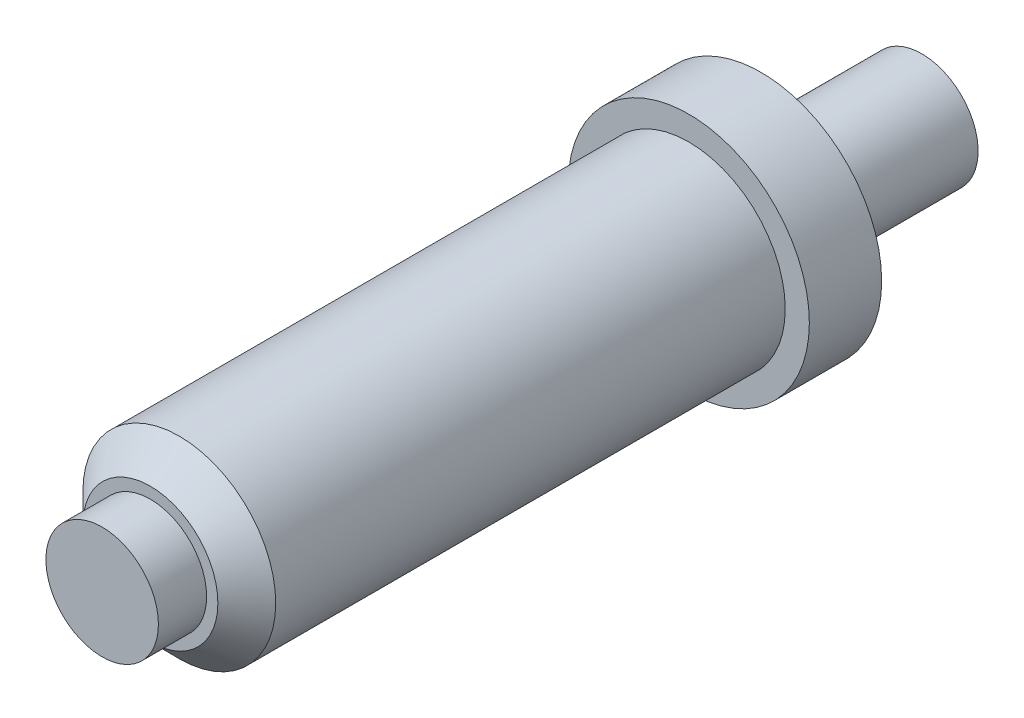
ISO-10303-21;
HEADER;
FILE_DESCRIPTION(('STEP AP214'),'2;1');
FILE_NAME('part.step','',(''),(''),'','','');
FILE_SCHEMA(('AUTOMOTIVE_DESIGN { 1 0 10303 214 1 1 1 1 }'));
ENDSEC;
DATA;
#1=APPLICATION_CONTEXT('core data for automotive mechanical design processes');
#2=APPLICATION_PROTOCOL_DEFINITION('international standard','automotive_design',2000,#1);
#3=PRODUCT_CONTEXT('',#1,'mechanical');
#4=PRODUCT('Part','Part','',(#3));
#5=PRODUCT_RELATED_PRODUCT_CATEGORY('part','',(#4));
#6=PRODUCT_DEFINITION_FORMATION('','',#4);
#7=PRODUCT_DEFINITION_CONTEXT('part definition',#1,'design');
#8=PRODUCT_DEFINITION('design','',#6,#7);
#9=PRODUCT_DEFINITION_SHAPE('','',#8);
#10=(LENGTH_UNIT() NAMED_UNIT(*) SI_UNIT(.MILLI.,.METRE.));
#11=(NAMED_UNIT(*) PLANE_ANGLE_UNIT() SI_UNIT($,.RADIAN.));
#12=(NAMED_UNIT(*) SI_UNIT($,.STERADIAN.) SOLID_ANGLE_UNIT());
#13=UNCERTAINTY_MEASURE_WITH_UNIT(LENGTH_MEASURE(1.E-05),#10,'distance_accuracy_value','');
#14=(GEOMETRIC_REPRESENTATION_CONTEXT(3) GLOBAL_UNCERTAINTY_ASSIGNED_CONTEXT((#13)) GLOBAL_UNIT_ASSIGNED_CONTEXT((#10,
#11,#12)) REPRESENTATION_CONTEXT('',''));
#15=CARTESIAN_POINT('',(0.,0.,0.));
#16=DIRECTION('',(0.,0.,1.));
#17=DIRECTION('',(1.,0.,0.));
#18=AXIS2_PLACEMENT_3D('',#15,#16,#17);
#19=CARTESIAN_POINT('',(0.,0.,38.));
#20=DIRECTION('',(0.,0.,-1.));
#21=DIRECTION('',(-1.,0.,0.));
#22=AXIS2_PLACEMENT_3D('',#19,#20,#21);
#23=CYLINDRICAL_SURFACE('',#22,6.);
#24=CARTESIAN_POINT('',(0.,0.,36.2));
#25=DIRECTION('',(0.,0.,1.));
#26=DIRECTION('',(1.,0.,0.));
#27=AXIS2_PLACEMENT_3D('',#24,#25,#26);
#28=CIRCLE('',#27,6.);
#29=CARTESIAN_POINT('',(6.,0.,36.2));
#30=VERTEX_POINT('',#29);
#31=EDGE_CURVE('E10',#30,#30,#28,.F.);
#32=ORIENTED_EDGE('',*,*,#31,.T.);
#33=EDGE_LOOP('',(#32));
#34=FACE_BOUND('',#33,.T.);
#35=CARTESIAN_POINT('',(0.,0.,4.5));
#36=DIRECTION('',(0.,0.,-1.));
#37=DIRECTION('',(-1.,0.,0.));
#38=AXIS2_PLACEMENT_3D('',#35,#36,#37);
#39=CIRCLE('',#38,6.);
#40=CARTESIAN_POINT('',(-6.,0.,4.5));
#41=VERTEX_POINT('',#40);
#42=EDGE_CURVE('E47',#41,#41,#39,.T.);
#43=ORIENTED_EDGE('',*,*,#42,.F.);
#44=EDGE_LOOP('',(#43));
#45=FACE_BOUND('',#44,.T.);
#46=ADVANCED_FACE('F35',(#34,#45),#23,.T.);
#47=CARTESIAN_POINT('',(0.,0.,38.));
#48=DIRECTION('',(0.,0.,1.));
#49=DIRECTION('',(1.,0.,0.));
#50=AXIS2_PLACEMENT_3D('',#47,#48,#49);
#51=PLANE('',#50);
#52=CARTESIAN_POINT('',(0.,0.,38.));
#53=DIRECTION('',(0.,0.,1.));
#54=DIRECTION('',(1.,0.,0.));
#55=AXIS2_PLACEMENT_3D('',#52,#53,#54);
#56=CIRCLE('',#55,4.19999999999998);
#57=CARTESIAN_POINT('',(4.19999999999998,0.,38.));
#58=VERTEX_POINT('',#57);
#59=EDGE_CURVE('E43',#58,#58,#56,.T.);
#60=ORIENTED_EDGE('',*,*,#59,.T.);
#61=EDGE_LOOP('',(#60));
#62=FACE_BOUND('',#61,.T.);
#63=CARTESIAN_POINT('',(0.,0.,38.));
#64=DIRECTION('',(0.,0.,1.));
#65=DIRECTION('',(1.,0.,0.));
#66=AXIS2_PLACEMENT_3D('',#63,#64,#65);
#67=CIRCLE('',#66,3.5);
#68=CARTESIAN_POINT('',(3.5,0.,38.));
#69=VERTEX_POINT('',#68);
#70=EDGE_CURVE('E54',#69,#69,#67,.T.);
#71=ORIENTED_EDGE('',*,*,#70,.F.);
#72=EDGE_LOOP('',(#71));
#73=FACE_BOUND('',#72,.T.);
#74=ADVANCED_FACE('F90',(#62,#73),#51,.T.);
#75=CARTESIAN_POINT('',(0.,0.,41.));
#76=DIRECTION('',(0.,0.,-1.));
#77=DIRECTION('',(-1.,0.,0.));
#78=AXIS2_PLACEMENT_3D('',#75,#76,#77);
#79=CYLINDRICAL_SURFACE('',#78,3.5);
#80=CARTESIAN_POINT('',(0.,0.,41.));
#81=DIRECTION('',(0.,0.,1.));
#82=DIRECTION('',(1.,0.,0.));
#83=AXIS2_PLACEMENT_3D('',#80,#81,#82);
#84=CIRCLE('',#83,3.5);
#85=CARTESIAN_POINT('',(3.5,0.,41.));
#86=VERTEX_POINT('',#85);
#87=EDGE_CURVE('E57',#86,#86,#84,.T.);
#88=ORIENTED_EDGE('',*,*,#87,.F.);
#89=EDGE_LOOP('',(#88));
#90=FACE_BOUND('',#89,.T.);
#91=ORIENTED_EDGE('',*,*,#70,.T.);
#92=EDGE_LOOP('',(#91));
#93=FACE_BOUND('',#92,.T.);
#94=ADVANCED_FACE('F94',(#90,#93),#79,.T.);
#95=CARTESIAN_POINT('',(0.,0.,41.));
#96=DIRECTION('',(0.,0.,1.));
#97=DIRECTION('',(1.,0.,0.));
#98=AXIS2_PLACEMENT_3D('',#95,#96,#97);
#99=PLANE('',#98);
#100=ORIENTED_EDGE('',*,*,#87,.T.);
#101=EDGE_LOOP('',(#100));
#102=FACE_BOUND('',#101,.T.);
#103=ADVANCED_FACE('F87',(#102),#99,.T.);
#104=CARTESIAN_POINT('',(0.,0.,4.5));
#105=DIRECTION('',(0.,0.,-1.));
#106=DIRECTION('',(-1.,0.,0.));
#107=AXIS2_PLACEMENT_3D('',#104,#105,#106);
#108=CYLINDRICAL_SURFACE('',#107,7.5);
#109=CARTESIAN_POINT('',(0.,0.,4.5));
#110=DIRECTION('',(0.,0.,-1.));
#111=DIRECTION('',(-1.,0.,0.));
#112=AXIS2_PLACEMENT_3D('',#109,#110,#111);
#113=CIRCLE('',#112,7.5);
#114=CARTESIAN_POINT('',(-7.5,0.,4.5));
#115=VERTEX_POINT('',#114);
#116=EDGE_CURVE('E65',#115,#115,#113,.T.);
#117=ORIENTED_EDGE('',*,*,#116,.T.);
#118=EDGE_LOOP('',(#117));
#119=FACE_BOUND('',#118,.T.);
#120=CARTESIAN_POINT('',(0.,0.,0.));
#121=DIRECTION('',(0.,0.,-1.));
#122=DIRECTION('',(-1.,0.,0.));
#123=AXIS2_PLACEMENT_3D('',#120,#121,#122);
#124=CIRCLE('',#123,7.5);
#125=CARTESIAN_POINT('',(-7.5,0.,0.));
#126=VERTEX_POINT('',#125);
#127=EDGE_CURVE('E66',#126,#126,#124,.T.);
#128=ORIENTED_EDGE('',*,*,#127,.F.);
#129=EDGE_LOOP('',(#128));
#130=FACE_BOUND('',#129,.T.);
#131=ADVANCED_FACE('F72',(#119,#130),#108,.T.);
#132=CARTESIAN_POINT('',(0.,0.,4.5));
#133=DIRECTION('',(0.,0.,-1.));
#134=DIRECTION('',(-1.,0.,0.));
#135=AXIS2_PLACEMENT_3D('',#132,#133,#134);
#136=PLANE('',#135);
#137=ORIENTED_EDGE('',*,*,#42,.T.);
#138=EDGE_LOOP('',(#137));
#139=FACE_BOUND('',#138,.T.);
#140=ORIENTED_EDGE('',*,*,#116,.F.);
#141=EDGE_LOOP('',(#140));
#142=FACE_BOUND('',#141,.T.);
#143=ADVANCED_FACE('F75',(#139,#142),#136,.F.);
#144=CARTESIAN_POINT('',(0.,0.,-10.));
#145=DIRECTION('',(0.,0.,-1.));
#146=DIRECTION('',(-1.,0.,0.));
#147=AXIS2_PLACEMENT_3D('',#144,#145,#146);
#148=PLANE('',#147);
#149=CARTESIAN_POINT('',(0.,0.,-10.));
#150=DIRECTION('',(0.,0.,-1.));
#151=DIRECTION('',(-1.,0.,0.));
#152=AXIS2_PLACEMENT_3D('',#149,#150,#151);
#153=CIRCLE('',#152,3.5);
#154=CARTESIAN_POINT('',(-3.5,0.,-10.));
#155=VERTEX_POINT('',#154);
#156=EDGE_CURVE('E60',#155,#155,#153,.T.);
#157=ORIENTED_EDGE('',*,*,#156,.T.);
#158=EDGE_LOOP('',(#157));
#159=FACE_BOUND('',#158,.T.);
#160=ADVANCED_FACE('F77',(#159),#148,.T.);
#161=CARTESIAN_POINT('',(0.,0.,-10.));
#162=DIRECTION('',(0.,0.,1.));
#163=DIRECTION('',(1.,0.,0.));
#164=AXIS2_PLACEMENT_3D('',#161,#162,#163);
#165=CYLINDRICAL_SURFACE('',#164,3.5);
#166=ORIENTED_EDGE('',*,*,#156,.F.);
#167=EDGE_LOOP('',(#166));
#168=FACE_BOUND('',#167,.T.);
#169=CARTESIAN_POINT('',(0.,0.,0.));
#170=DIRECTION('',(0.,0.,-1.));
#171=DIRECTION('',(-1.,0.,0.));
#172=AXIS2_PLACEMENT_3D('',#169,#170,#171);
#173=CIRCLE('',#172,3.5);
#174=CARTESIAN_POINT('',(-3.5,0.,0.));
#175=VERTEX_POINT('',#174);
#176=EDGE_CURVE('E51',#175,#175,#173,.T.);
#177=ORIENTED_EDGE('',*,*,#176,.T.);
#178=EDGE_LOOP('',(#177));
#179=FACE_BOUND('',#178,.T.);
#180=ADVANCED_FACE('F84',(#168,#179),#165,.T.);
#181=CARTESIAN_POINT('',(0.,0.,0.));
#182=DIRECTION('',(0.,0.,1.));
#183=DIRECTION('',(1.,0.,0.));
#184=AXIS2_PLACEMENT_3D('',#181,#182,#183);
#185=PLANE('',#184);
#186=ORIENTED_EDGE('',*,*,#176,.F.);
#187=EDGE_LOOP('',(#186));
#188=FACE_BOUND('',#187,.T.);
#189=ORIENTED_EDGE('',*,*,#127,.T.);
#190=EDGE_LOOP('',(#189));
#191=FACE_BOUND('',#190,.T.);
#192=ADVANCED_FACE('F98',(#188,#191),#185,.F.);
#193=CARTESIAN_POINT('',(0.,0.,38.));
#194=DIRECTION('',(0.,0.,-1.));
#195=DIRECTION('',(-1.,0.,0.));
#196=AXIS2_PLACEMENT_3D('',#193,#194,#195);
#197=CONICAL_SURFACE('',#196,4.19999999999998,0.785398163397447);
#198=ORIENTED_EDGE('',*,*,#31,.F.);
#199=EDGE_LOOP('',(#198));
#200=FACE_BOUND('',#199,.T.);
#201=ORIENTED_EDGE('',*,*,#59,.F.);
#202=EDGE_LOOP('',(#201));
#203=FACE_BOUND('',#202,.T.);
#204=ADVANCED_FACE('F38',(#200,#203),#197,.T.);
#205=CLOSED_SHELL('',(#46,#74,#94,#103,#131,#143,#160,#180,#192,#204));
#206=MANIFOLD_SOLID_BREP('B2',#205);
#207=ADVANCED_BREP_SHAPE_REPRESENTATION('',(#18,#206),#14);
#208=SHAPE_DEFINITION_REPRESENTATION(#9,#207);
ENDSEC;
END-ISO-10303-21;
